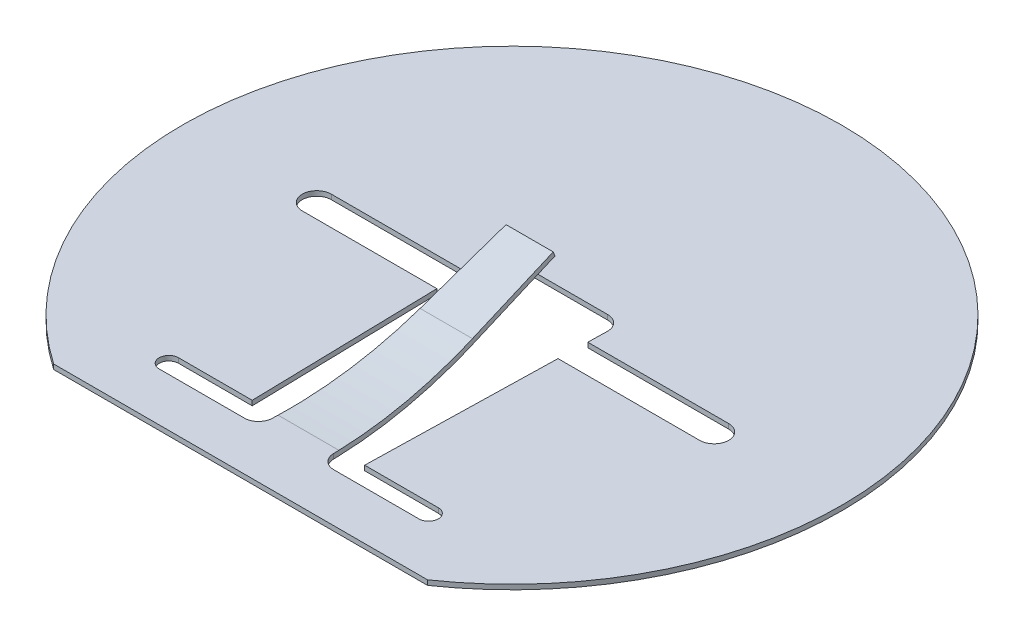
ISO-10303-21;
HEADER;
FILE_DESCRIPTION(('STEP AP214'),'2;1');
FILE_NAME('part.step','',(''),(''),'','','');
FILE_SCHEMA(('AUTOMOTIVE_DESIGN { 1 0 10303 214 1 1 1 1 }'));
ENDSEC;
DATA;
#1=APPLICATION_CONTEXT('core data for automotive mechanical design processes');
#2=APPLICATION_PROTOCOL_DEFINITION('international standard','automotive_design',2000,#1);
#3=PRODUCT_CONTEXT('',#1,'mechanical');
#4=PRODUCT('Part','Part','',(#3));
#5=PRODUCT_RELATED_PRODUCT_CATEGORY('part','',(#4));
#6=PRODUCT_DEFINITION_FORMATION('','',#4);
#7=PRODUCT_DEFINITION_CONTEXT('part definition',#1,'design');
#8=PRODUCT_DEFINITION('design','',#6,#7);
#9=PRODUCT_DEFINITION_SHAPE('','',#8);
#10=(LENGTH_UNIT() NAMED_UNIT(*) SI_UNIT(.MILLI.,.METRE.));
#11=(NAMED_UNIT(*) PLANE_ANGLE_UNIT() SI_UNIT($,.RADIAN.));
#12=(NAMED_UNIT(*) SI_UNIT($,.STERADIAN.) SOLID_ANGLE_UNIT());
#13=UNCERTAINTY_MEASURE_WITH_UNIT(LENGTH_MEASURE(1.E-05),#10,'distance_accuracy_value','');
#14=(GEOMETRIC_REPRESENTATION_CONTEXT(3) GLOBAL_UNCERTAINTY_ASSIGNED_CONTEXT((#13)) GLOBAL_UNIT_ASSIGNED_CONTEXT((#10,
#11,#12)) REPRESENTATION_CONTEXT('',''));
#15=CARTESIAN_POINT('',(0.,0.,0.));
#16=DIRECTION('',(0.,0.,1.));
#17=DIRECTION('',(1.,0.,0.));
#18=AXIS2_PLACEMENT_3D('',#15,#16,#17);
#19=CARTESIAN_POINT('',(0.,0.125,0.));
#20=DIRECTION('',(0.,1.,0.));
#21=DIRECTION('',(0.,0.,1.));
#22=AXIS2_PLACEMENT_3D('',#19,#20,#21);
#23=PLANE('',#22);
#24=CARTESIAN_POINT('',(0.,0.125,0.));
#25=DIRECTION('',(0.,1.,0.));
#26=DIRECTION('',(0.,0.,1.));
#27=AXIS2_PLACEMENT_3D('',#24,#25,#26);
#28=CIRCLE('',#27,8.5);
#29=CARTESIAN_POINT('',(4.82182538049648,0.125,7.));
#30=VERTEX_POINT('',#29);
#31=CARTESIAN_POINT('',(-4.82182538049648,0.125,7.));
#32=VERTEX_POINT('',#31);
#33=EDGE_CURVE('E396',#30,#32,#28,.T.);
#34=ORIENTED_EDGE('',*,*,#33,.T.);
#35=DIRECTION('',(1.,0.,0.));
#36=VECTOR('',#35,1.);
#37=CARTESIAN_POINT('',(4.82182538049648,0.125,7.));
#38=LINE('',#37,#36);
#39=EDGE_CURVE('E399',#32,#30,#38,.T.);
#40=ORIENTED_EDGE('',*,*,#39,.T.);
#41=EDGE_LOOP('',(#34,#40));
#42=FACE_BOUND('',#41,.T.);
#43=DIRECTION('',(1.,0.,0.));
#44=VECTOR('',#43,1.);
#45=CARTESIAN_POINT('',(-3.35,0.125,5.75));
#46=LINE('',#45,#44);
#47=CARTESIAN_POINT('',(1.15394197095874,0.125,5.75));
#48=VERTEX_POINT('',#47);
#49=CARTESIAN_POINT('',(3.35,0.125,5.75));
#50=VERTEX_POINT('',#49);
#51=EDGE_CURVE('E276',#48,#50,#46,.T.);
#52=ORIENTED_EDGE('',*,*,#51,.F.);
#53=CARTESIAN_POINT('',(1.15394197095874,0.125,5.385));
#54=DIRECTION('',(0.,1.,0.));
#55=DIRECTION('',(0.,0.,1.));
#56=AXIS2_PLACEMENT_3D('',#53,#54,#55);
#57=CIRCLE('',#56,0.365);
#58=CARTESIAN_POINT('',(0.789114629435761,0.125,5.39622545666225));
#59=VERTEX_POINT('',#58);
#60=EDGE_CURVE('E422',#48,#59,#57,.F.);
#61=ORIENTED_EDGE('',*,*,#60,.T.);
#62=DIRECTION('',(-0.030754675786974,0.,-0.999526963076654));
#63=VECTOR('',#62,1.);
#64=CARTESIAN_POINT('',(0.622487585717664,0.125,-0.0191534641759281));
#65=LINE('',#64,#63);
#66=CARTESIAN_POINT('',(0.784615384615385,0.125,5.25));
#67=VERTEX_POINT('',#66);
#68=EDGE_CURVE('E426',#59,#67,#65,.T.);
#69=ORIENTED_EDGE('',*,*,#68,.T.);
#70=DIRECTION('',(1.,0.,0.));
#71=VECTOR('',#70,1.);
#72=CARTESIAN_POINT('',(0.8,0.125,5.25));
#73=LINE('',#72,#71);
#74=CARTESIAN_POINT('',(-0.784615384615385,0.125,5.25));
#75=VERTEX_POINT('',#74);
#76=EDGE_CURVE('E537',#75,#67,#73,.T.);
#77=ORIENTED_EDGE('',*,*,#76,.F.);
#78=DIRECTION('',(-0.030754675786974,0.,0.999526963076654));
#79=VECTOR('',#78,1.);
#80=CARTESIAN_POINT('',(-0.622487585717664,0.125,-0.0191534641759281));
#81=LINE('',#80,#79);
#82=CARTESIAN_POINT('',(-0.789114629435762,0.125,5.39622545666225));
#83=VERTEX_POINT('',#82);
#84=EDGE_CURVE('E252',#75,#83,#81,.T.);
#85=ORIENTED_EDGE('',*,*,#84,.T.);
#86=CARTESIAN_POINT('',(-1.15394197095874,0.125,5.385));
#87=DIRECTION('',(0.,1.,0.));
#88=DIRECTION('',(0.,0.,1.));
#89=AXIS2_PLACEMENT_3D('',#86,#87,#88);
#90=CIRCLE('',#89,0.365);
#91=CARTESIAN_POINT('',(-1.15394197095874,0.125,5.75));
#92=VERTEX_POINT('',#91);
#93=EDGE_CURVE('E40',#83,#92,#90,.F.);
#94=ORIENTED_EDGE('',*,*,#93,.T.);
#95=CARTESIAN_POINT('',(-3.35,0.125,5.75));
#96=VERTEX_POINT('',#95);
#97=EDGE_CURVE('E277',#96,#92,#46,.T.);
#98=ORIENTED_EDGE('',*,*,#97,.F.);
#99=CARTESIAN_POINT('',(-3.35,0.125,5.5));
#100=DIRECTION('',(0.,1.,0.));
#101=DIRECTION('',(0.,0.,1.));
#102=AXIS2_PLACEMENT_3D('',#99,#100,#101);
#103=CIRCLE('',#102,0.249999999999998);
#104=CARTESIAN_POINT('',(-3.35,0.125,5.25));
#105=VERTEX_POINT('',#104);
#106=EDGE_CURVE('E274',#105,#96,#103,.T.);
#107=ORIENTED_EDGE('',*,*,#106,.F.);
#108=DIRECTION('',(-1.,0.,0.));
#109=VECTOR('',#108,1.);
#110=CARTESIAN_POINT('',(-1.45,0.125,5.25000000000001));
#111=LINE('',#110,#109);
#112=CARTESIAN_POINT('',(-1.45,0.125,5.25000000000001));
#113=VERTEX_POINT('',#112);
#114=EDGE_CURVE('E272',#113,#105,#111,.T.);
#115=ORIENTED_EDGE('',*,*,#114,.F.);
#116=DIRECTION('',(0.0230707807872646,0.,0.999733834114794));
#117=VECTOR('',#116,1.);
#118=CARTESIAN_POINT('',(-1.5625,0.125,0.375));
#119=LINE('',#118,#117);
#120=CARTESIAN_POINT('',(-1.5625,0.125,0.375));
#121=VERTEX_POINT('',#120);
#122=EDGE_CURVE('E270',#121,#113,#119,.T.);
#123=ORIENTED_EDGE('',*,*,#122,.F.);
#124=DIRECTION('',(1.,0.,0.));
#125=VECTOR('',#124,1.);
#126=CARTESIAN_POINT('',(-5.035,0.125,0.375));
#127=LINE('',#126,#125);
#128=CARTESIAN_POINT('',(-5.035,0.125,0.375));
#129=VERTEX_POINT('',#128);
#130=EDGE_CURVE('E267',#129,#121,#127,.T.);
#131=ORIENTED_EDGE('',*,*,#130,.F.);
#132=CARTESIAN_POINT('',(-5.035,0.125,0.));
#133=DIRECTION('',(0.,1.,0.));
#134=DIRECTION('',(0.,0.,1.));
#135=AXIS2_PLACEMENT_3D('',#132,#133,#134);
#136=CIRCLE('',#135,0.375);
#137=CARTESIAN_POINT('',(-5.035,0.125,-0.375));
#138=VERTEX_POINT('',#137);
#139=EDGE_CURVE('E265',#138,#129,#136,.T.);
#140=ORIENTED_EDGE('',*,*,#139,.F.);
#141=DIRECTION('',(-1.,0.,0.));
#142=VECTOR('',#141,1.);
#143=CARTESIAN_POINT('',(-5.035,0.125,-0.375));
#144=LINE('',#143,#142);
#145=CARTESIAN_POINT('',(-1.5798076923077,0.125,-0.375));
#146=VERTEX_POINT('',#145);
#147=EDGE_CURVE('E302',#146,#138,#144,.T.);
#148=ORIENTED_EDGE('',*,*,#147,.F.);
#149=DIRECTION('',(0.0230707807872637,0.,0.999733834114794));
#150=VECTOR('',#149,1.);
#151=CARTESIAN_POINT('',(-1.59114650285857,0.125,-0.866348457204776));
#152=LINE('',#151,#150);
#153=CARTESIAN_POINT('',(-1.59114650285857,0.125,-0.866348457204776));
#154=VERTEX_POINT('',#153);
#155=EDGE_CURVE('E299',#154,#146,#152,.T.);
#156=ORIENTED_EDGE('',*,*,#155,.F.);
#157=CARTESIAN_POINT('',(-1.21624631506553,0.125,-0.875));
#158=DIRECTION('',(0.,1.,0.));
#159=DIRECTION('',(0.,0.,-1.));
#160=AXIS2_PLACEMENT_3D('',#157,#158,#159);
#161=CIRCLE('',#160,0.375);
#162=CARTESIAN_POINT('',(-1.21624631506553,0.125,-1.25));
#163=VERTEX_POINT('',#162);
#164=EDGE_CURVE('E297',#163,#154,#161,.T.);
#165=ORIENTED_EDGE('',*,*,#164,.F.);
#166=DIRECTION('',(-1.,0.,0.));
#167=VECTOR('',#166,1.);
#168=CARTESIAN_POINT('',(-1.21624631506553,0.125,-1.25));
#169=LINE('',#168,#167);
#170=CARTESIAN_POINT('',(1.21624631506553,0.125,-1.25));
#171=VERTEX_POINT('',#170);
#172=EDGE_CURVE('E295',#171,#163,#169,.T.);
#173=ORIENTED_EDGE('',*,*,#172,.F.);
#174=CARTESIAN_POINT('',(1.21624631506553,0.125,-0.875));
#175=DIRECTION('',(0.,1.,0.));
#176=DIRECTION('',(0.,0.,-1.));
#177=AXIS2_PLACEMENT_3D('',#174,#175,#176);
#178=CIRCLE('',#177,0.375);
#179=CARTESIAN_POINT('',(1.59114650285858,0.125,-0.866348457204776));
#180=VERTEX_POINT('',#179);
#181=EDGE_CURVE('E293',#180,#171,#178,.T.);
#182=ORIENTED_EDGE('',*,*,#181,.F.);
#183=DIRECTION('',(0.0230707807872642,0.,-0.999733834114794));
#184=VECTOR('',#183,1.);
#185=CARTESIAN_POINT('',(1.59114650285858,0.125,-0.866348457204776));
#186=LINE('',#185,#184);
#187=CARTESIAN_POINT('',(1.5798076923077,0.125,-0.375));
#188=VERTEX_POINT('',#187);
#189=EDGE_CURVE('E291',#188,#180,#186,.T.);
#190=ORIENTED_EDGE('',*,*,#189,.F.);
#191=DIRECTION('',(-1.,0.,0.));
#192=VECTOR('',#191,1.);
#193=CARTESIAN_POINT('',(1.5798076923077,0.125,-0.375));
#194=LINE('',#193,#192);
#195=CARTESIAN_POINT('',(5.215,0.125,-0.375));
#196=VERTEX_POINT('',#195);
#197=EDGE_CURVE('E289',#196,#188,#194,.T.);
#198=ORIENTED_EDGE('',*,*,#197,.F.);
#199=CARTESIAN_POINT('',(5.215,0.125,0.));
#200=DIRECTION('',(0.,1.,0.));
#201=DIRECTION('',(0.,0.,1.));
#202=AXIS2_PLACEMENT_3D('',#199,#200,#201);
#203=CIRCLE('',#202,0.375);
#204=CARTESIAN_POINT('',(5.215,0.125,0.375));
#205=VERTEX_POINT('',#204);
#206=EDGE_CURVE('E287',#205,#196,#203,.T.);
#207=ORIENTED_EDGE('',*,*,#206,.F.);
#208=DIRECTION('',(1.,0.,0.));
#209=VECTOR('',#208,1.);
#210=CARTESIAN_POINT('',(1.5625,0.125,0.375));
#211=LINE('',#210,#209);
#212=CARTESIAN_POINT('',(1.5625,0.125,0.375));
#213=VERTEX_POINT('',#212);
#214=EDGE_CURVE('E285',#213,#205,#211,.T.);
#215=ORIENTED_EDGE('',*,*,#214,.F.);
#216=DIRECTION('',(0.0230707807872644,0.,-0.999733834114794));
#217=VECTOR('',#216,1.);
#218=CARTESIAN_POINT('',(1.5625,0.125,0.375));
#219=LINE('',#218,#217);
#220=CARTESIAN_POINT('',(1.45,0.125,5.25));
#221=VERTEX_POINT('',#220);
#222=EDGE_CURVE('E283',#221,#213,#219,.T.);
#223=ORIENTED_EDGE('',*,*,#222,.F.);
#224=DIRECTION('',(-1.,0.,0.));
#225=VECTOR('',#224,1.);
#226=CARTESIAN_POINT('',(1.45,0.125,5.25));
#227=LINE('',#226,#225);
#228=CARTESIAN_POINT('',(3.35,0.125,5.25));
#229=VERTEX_POINT('',#228);
#230=EDGE_CURVE('E281',#229,#221,#227,.T.);
#231=ORIENTED_EDGE('',*,*,#230,.F.);
#232=CARTESIAN_POINT('',(3.35,0.125,5.5));
#233=DIRECTION('',(0.,1.,0.));
#234=DIRECTION('',(0.,0.,-1.));
#235=AXIS2_PLACEMENT_3D('',#232,#233,#234);
#236=CIRCLE('',#235,0.25);
#237=EDGE_CURVE('E279',#50,#229,#236,.T.);
#238=ORIENTED_EDGE('',*,*,#237,.F.);
#239=EDGE_LOOP('',(#52,#61,#69,#77,#85,#94,#98,#107,#115,#123,#131,#140,#148,#156,#165,#173,
#182,#190,#198,#207,#215,#223,#231,#238));
#240=FACE_BOUND('',#239,.T.);
#241=ADVANCED_FACE('F32',(#42,#240),#23,.T.);
#242=CARTESIAN_POINT('',(0.,0.,0.));
#243=DIRECTION('',(0.,1.,0.));
#244=DIRECTION('',(0.,0.,1.));
#245=AXIS2_PLACEMENT_3D('',#242,#243,#244);
#246=PLANE('',#245);
#247=CARTESIAN_POINT('',(0.,0.,0.));
#248=DIRECTION('',(0.,1.,0.));
#249=DIRECTION('',(0.,0.,1.));
#250=AXIS2_PLACEMENT_3D('',#247,#248,#249);
#251=CIRCLE('',#250,8.5);
#252=CARTESIAN_POINT('',(4.82182538049648,0.,7.));
#253=VERTEX_POINT('',#252);
#254=CARTESIAN_POINT('',(-4.82182538049648,0.,7.));
#255=VERTEX_POINT('',#254);
#256=EDGE_CURVE('E395',#253,#255,#251,.T.);
#257=ORIENTED_EDGE('',*,*,#256,.F.);
#258=DIRECTION('',(1.,0.,0.));
#259=VECTOR('',#258,1.);
#260=CARTESIAN_POINT('',(4.82182538049648,0.,7.));
#261=LINE('',#260,#259);
#262=EDGE_CURVE('E400',#255,#253,#261,.T.);
#263=ORIENTED_EDGE('',*,*,#262,.F.);
#264=EDGE_LOOP('',(#257,#263));
#265=FACE_BOUND('',#264,.T.);
#266=DIRECTION('',(0.030754675786974,0.,0.999526963076654));
#267=VECTOR('',#266,1.);
#268=CARTESIAN_POINT('',(0.8,0.,5.75));
#269=LINE('',#268,#267);
#270=CARTESIAN_POINT('',(0.784615384615385,0.,5.25));
#271=VERTEX_POINT('',#270);
#272=CARTESIAN_POINT('',(0.789114629435761,0.,5.39622545666225));
#273=VERTEX_POINT('',#272);
#274=EDGE_CURVE('E442',#271,#273,#269,.T.);
#275=ORIENTED_EDGE('',*,*,#274,.T.);
#276=CARTESIAN_POINT('',(1.15394197095874,0.,5.385));
#277=DIRECTION('',(0.,1.,0.));
#278=DIRECTION('',(0.,0.,1.));
#279=AXIS2_PLACEMENT_3D('',#276,#277,#278);
#280=CIRCLE('',#279,0.365);
#281=CARTESIAN_POINT('',(1.15394197095874,0.,5.75));
#282=VERTEX_POINT('',#281);
#283=EDGE_CURVE('E420',#273,#282,#280,.T.);
#284=ORIENTED_EDGE('',*,*,#283,.T.);
#285=DIRECTION('',(1.,0.,0.));
#286=VECTOR('',#285,1.);
#287=CARTESIAN_POINT('',(-3.35,0.,5.75));
#288=LINE('',#287,#286);
#289=CARTESIAN_POINT('',(3.35,0.,5.75));
#290=VERTEX_POINT('',#289);
#291=EDGE_CURVE('E319',#282,#290,#288,.T.);
#292=ORIENTED_EDGE('',*,*,#291,.T.);
#293=CARTESIAN_POINT('',(3.35,0.,5.5));
#294=DIRECTION('',(0.,1.,0.));
#295=DIRECTION('',(0.,0.,-1.));
#296=AXIS2_PLACEMENT_3D('',#293,#294,#295);
#297=CIRCLE('',#296,0.25);
#298=CARTESIAN_POINT('',(3.35,0.,5.25));
#299=VERTEX_POINT('',#298);
#300=EDGE_CURVE('E322',#290,#299,#297,.T.);
#301=ORIENTED_EDGE('',*,*,#300,.T.);
#302=DIRECTION('',(-1.,0.,0.));
#303=VECTOR('',#302,1.);
#304=CARTESIAN_POINT('',(1.45,0.,5.25));
#305=LINE('',#304,#303);
#306=CARTESIAN_POINT('',(1.45,0.,5.25));
#307=VERTEX_POINT('',#306);
#308=EDGE_CURVE('E325',#299,#307,#305,.T.);
#309=ORIENTED_EDGE('',*,*,#308,.T.);
#310=DIRECTION('',(0.0230707807872644,0.,-0.999733834114794));
#311=VECTOR('',#310,1.);
#312=CARTESIAN_POINT('',(1.5625,0.,0.375));
#313=LINE('',#312,#311);
#314=CARTESIAN_POINT('',(1.5625,0.,0.375));
#315=VERTEX_POINT('',#314);
#316=EDGE_CURVE('E328',#307,#315,#313,.T.);
#317=ORIENTED_EDGE('',*,*,#316,.T.);
#318=DIRECTION('',(1.,0.,0.));
#319=VECTOR('',#318,1.);
#320=CARTESIAN_POINT('',(1.5625,0.,0.375));
#321=LINE('',#320,#319);
#322=CARTESIAN_POINT('',(5.215,0.,0.375));
#323=VERTEX_POINT('',#322);
#324=EDGE_CURVE('E331',#315,#323,#321,.T.);
#325=ORIENTED_EDGE('',*,*,#324,.T.);
#326=CARTESIAN_POINT('',(5.215,0.,0.));
#327=DIRECTION('',(0.,1.,0.));
#328=DIRECTION('',(0.,0.,1.));
#329=AXIS2_PLACEMENT_3D('',#326,#327,#328);
#330=CIRCLE('',#329,0.375);
#331=CARTESIAN_POINT('',(5.215,0.,-0.375));
#332=VERTEX_POINT('',#331);
#333=EDGE_CURVE('E334',#323,#332,#330,.T.);
#334=ORIENTED_EDGE('',*,*,#333,.T.);
#335=DIRECTION('',(-1.,0.,0.));
#336=VECTOR('',#335,1.);
#337=CARTESIAN_POINT('',(1.5798076923077,0.,-0.375));
#338=LINE('',#337,#336);
#339=CARTESIAN_POINT('',(1.5798076923077,0.,-0.375));
#340=VERTEX_POINT('',#339);
#341=EDGE_CURVE('E337',#332,#340,#338,.T.);
#342=ORIENTED_EDGE('',*,*,#341,.T.);
#343=DIRECTION('',(0.0230707807872642,0.,-0.999733834114794));
#344=VECTOR('',#343,1.);
#345=CARTESIAN_POINT('',(1.59114650285858,0.,-0.866348457204776));
#346=LINE('',#345,#344);
#347=CARTESIAN_POINT('',(1.59114650285858,0.,-0.866348457204776));
#348=VERTEX_POINT('',#347);
#349=EDGE_CURVE('E340',#340,#348,#346,.T.);
#350=ORIENTED_EDGE('',*,*,#349,.T.);
#351=CARTESIAN_POINT('',(1.21624631506553,0.,-0.875));
#352=DIRECTION('',(0.,1.,0.));
#353=DIRECTION('',(0.,0.,-1.));
#354=AXIS2_PLACEMENT_3D('',#351,#352,#353);
#355=CIRCLE('',#354,0.375);
#356=CARTESIAN_POINT('',(1.21624631506553,0.,-1.25));
#357=VERTEX_POINT('',#356);
#358=EDGE_CURVE('E343',#348,#357,#355,.T.);
#359=ORIENTED_EDGE('',*,*,#358,.T.);
#360=DIRECTION('',(-1.,0.,0.));
#361=VECTOR('',#360,1.);
#362=CARTESIAN_POINT('',(-1.21624631506553,0.,-1.25));
#363=LINE('',#362,#361);
#364=CARTESIAN_POINT('',(-1.21624631506553,0.,-1.25));
#365=VERTEX_POINT('',#364);
#366=EDGE_CURVE('E346',#357,#365,#363,.T.);
#367=ORIENTED_EDGE('',*,*,#366,.T.);
#368=CARTESIAN_POINT('',(-1.21624631506553,0.,-0.875));
#369=DIRECTION('',(0.,1.,0.));
#370=DIRECTION('',(0.,0.,-1.));
#371=AXIS2_PLACEMENT_3D('',#368,#369,#370);
#372=CIRCLE('',#371,0.375);
#373=CARTESIAN_POINT('',(-1.59114650285857,0.,-0.866348457204776));
#374=VERTEX_POINT('',#373);
#375=EDGE_CURVE('E349',#365,#374,#372,.T.);
#376=ORIENTED_EDGE('',*,*,#375,.T.);
#377=DIRECTION('',(0.0230707807872637,0.,0.999733834114794));
#378=VECTOR('',#377,1.);
#379=CARTESIAN_POINT('',(-1.59114650285857,0.,-0.866348457204776));
#380=LINE('',#379,#378);
#381=CARTESIAN_POINT('',(-1.5798076923077,0.,-0.375));
#382=VERTEX_POINT('',#381);
#383=EDGE_CURVE('E352',#374,#382,#380,.T.);
#384=ORIENTED_EDGE('',*,*,#383,.T.);
#385=DIRECTION('',(-1.,0.,0.));
#386=VECTOR('',#385,1.);
#387=CARTESIAN_POINT('',(-5.035,0.,-0.375));
#388=LINE('',#387,#386);
#389=CARTESIAN_POINT('',(-5.035,0.,-0.375));
#390=VERTEX_POINT('',#389);
#391=EDGE_CURVE('E268',#382,#390,#388,.T.);
#392=ORIENTED_EDGE('',*,*,#391,.T.);
#393=CARTESIAN_POINT('',(-5.035,0.,0.));
#394=DIRECTION('',(0.,1.,0.));
#395=DIRECTION('',(0.,0.,1.));
#396=AXIS2_PLACEMENT_3D('',#393,#394,#395);
#397=CIRCLE('',#396,0.375);
#398=CARTESIAN_POINT('',(-5.035,0.,0.375));
#399=VERTEX_POINT('',#398);
#400=EDGE_CURVE('E259',#390,#399,#397,.T.);
#401=ORIENTED_EDGE('',*,*,#400,.T.);
#402=DIRECTION('',(1.,0.,0.));
#403=VECTOR('',#402,1.);
#404=CARTESIAN_POINT('',(-5.035,0.,0.375));
#405=LINE('',#404,#403);
#406=CARTESIAN_POINT('',(-1.5625,0.,0.375));
#407=VERTEX_POINT('',#406);
#408=EDGE_CURVE('E307',#399,#407,#405,.T.);
#409=ORIENTED_EDGE('',*,*,#408,.T.);
#410=DIRECTION('',(0.0230707807872646,0.,0.999733834114794));
#411=VECTOR('',#410,1.);
#412=CARTESIAN_POINT('',(-1.5625,0.,0.375));
#413=LINE('',#412,#411);
#414=CARTESIAN_POINT('',(-1.45,0.,5.25000000000001));
#415=VERTEX_POINT('',#414);
#416=EDGE_CURVE('E310',#407,#415,#413,.T.);
#417=ORIENTED_EDGE('',*,*,#416,.T.);
#418=DIRECTION('',(-1.,0.,0.));
#419=VECTOR('',#418,1.);
#420=CARTESIAN_POINT('',(-1.45,0.,5.25000000000001));
#421=LINE('',#420,#419);
#422=CARTESIAN_POINT('',(-3.35,0.,5.25));
#423=VERTEX_POINT('',#422);
#424=EDGE_CURVE('E313',#415,#423,#421,.T.);
#425=ORIENTED_EDGE('',*,*,#424,.T.);
#426=CARTESIAN_POINT('',(-3.35,0.,5.5));
#427=DIRECTION('',(0.,1.,0.));
#428=DIRECTION('',(0.,0.,1.));
#429=AXIS2_PLACEMENT_3D('',#426,#427,#428);
#430=CIRCLE('',#429,0.249999999999998);
#431=CARTESIAN_POINT('',(-3.35,0.,5.75));
#432=VERTEX_POINT('',#431);
#433=EDGE_CURVE('E316',#423,#432,#430,.T.);
#434=ORIENTED_EDGE('',*,*,#433,.T.);
#435=CARTESIAN_POINT('',(-1.15394197095874,0.,5.75));
#436=VERTEX_POINT('',#435);
#437=EDGE_CURVE('E320',#432,#436,#288,.T.);
#438=ORIENTED_EDGE('',*,*,#437,.T.);
#439=CARTESIAN_POINT('',(-1.15394197095874,0.,5.385));
#440=DIRECTION('',(0.,1.,0.));
#441=DIRECTION('',(0.,0.,1.));
#442=AXIS2_PLACEMENT_3D('',#439,#440,#441);
#443=CIRCLE('',#442,0.365);
#444=CARTESIAN_POINT('',(-0.789114629435761,0.,5.39622545666224));
#445=VERTEX_POINT('',#444);
#446=EDGE_CURVE('E11',#436,#445,#443,.T.);
#447=ORIENTED_EDGE('',*,*,#446,.T.);
#448=DIRECTION('',(0.030754675786974,0.,-0.999526963076654));
#449=VECTOR('',#448,1.);
#450=CARTESIAN_POINT('',(-0.6,0.,-0.75));
#451=LINE('',#450,#449);
#452=CARTESIAN_POINT('',(-0.784615384615385,0.,5.25));
#453=VERTEX_POINT('',#452);
#454=EDGE_CURVE('E536',#445,#453,#451,.T.);
#455=ORIENTED_EDGE('',*,*,#454,.T.);
#456=DIRECTION('',(-1.,0.,0.));
#457=VECTOR('',#456,1.);
#458=CARTESIAN_POINT('',(0.8,0.,5.25));
#459=LINE('',#458,#457);
#460=EDGE_CURVE('E434',#271,#453,#459,.T.);
#461=ORIENTED_EDGE('',*,*,#460,.F.);
#462=EDGE_LOOP('',(#275,#284,#292,#301,#309,#317,#325,#334,#342,#350,#359,#367,#376,#384,#392,
#401,#409,#417,#425,#434,#438,#447,#455,#461));
#463=FACE_BOUND('',#462,.T.);
#464=ADVANCED_FACE('F440',(#265,#463),#246,.F.);
#465=CARTESIAN_POINT('',(0.8,0.670329243218185,1.65038285785138));
#466=DIRECTION('',(0.,-0.932967075678182,-0.359961714214862));
#467=DIRECTION('',(0.,0.359961714214862,-0.932967075678182));
#468=AXIS2_PLACEMENT_3D('',#465,#466,#467);
#469=PLANE('',#468);
#470=DIRECTION('',(-1.,0.,0.));
#471=VECTOR('',#470,1.);
#472=CARTESIAN_POINT('',(0.8,1.5,-0.5));
#473=LINE('',#472,#471);
#474=CARTESIAN_POINT('',(0.607692307692308,1.5,-0.5));
#475=VERTEX_POINT('',#474);
#476=CARTESIAN_POINT('',(-0.607692307692308,1.5,-0.5));
#477=VERTEX_POINT('',#476);
#478=EDGE_CURVE('E256',#475,#477,#473,.T.);
#479=ORIENTED_EDGE('',*,*,#478,.F.);
#480=DIRECTION('',(0.0286948583512325,-0.359813488377395,0.932582896415055));
#481=VECTOR('',#480,1.);
#482=CARTESIAN_POINT('',(0.673961798820952,0.669026851984155,1.65375846168094));
#483=LINE('',#482,#481);
#484=CARTESIAN_POINT('',(0.673857934087735,0.670329243218185,1.65038285785138));
#485=VERTEX_POINT('',#484);
#486=EDGE_CURVE('E236',#475,#485,#483,.T.);
#487=ORIENTED_EDGE('',*,*,#486,.T.);
#488=DIRECTION('',(-1.,0.,0.));
#489=VECTOR('',#488,1.);
#490=CARTESIAN_POINT('',(0.8,0.670329243218185,1.65038285785138));
#491=LINE('',#490,#489);
#492=CARTESIAN_POINT('',(-0.673857934087735,0.670329243218185,1.65038285785138));
#493=VERTEX_POINT('',#492);
#494=EDGE_CURVE('E257',#485,#493,#491,.T.);
#495=ORIENTED_EDGE('',*,*,#494,.T.);
#496=DIRECTION('',(0.0286948583512325,0.359813488377395,-0.932582896415055));
#497=VECTOR('',#496,1.);
#498=CARTESIAN_POINT('',(-0.672644366987676,0.685546527315119,1.61094192709948));
#499=LINE('',#498,#497);
#500=EDGE_CURVE('E553',#493,#477,#499,.T.);
#501=ORIENTED_EDGE('',*,*,#500,.T.);
#502=EDGE_LOOP('',(#479,#487,#495,#501));
#503=FACE_BOUND('',#502,.T.);
#504=ADVANCED_FACE('F564',(#503),#469,.T.);
#505=CARTESIAN_POINT('',(0.8,0.786950127677958,1.69537807212823));
#506=DIRECTION('',(0.,0.932967075678182,0.359961714214862));
#507=DIRECTION('',(0.,-0.359961714214862,0.932967075678182));
#508=AXIS2_PLACEMENT_3D('',#505,#506,#507);
#509=PLANE('',#508);
#510=DIRECTION('',(1.,0.,0.));
#511=VECTOR('',#510,1.);
#512=CARTESIAN_POINT('',(0.8,0.786950127677958,1.69537807212823));
#513=LINE('',#512,#511);
#514=CARTESIAN_POINT('',(-0.67524240221933,0.786950127677958,1.69537807212823));
#515=VERTEX_POINT('',#514);
#516=CARTESIAN_POINT('',(0.67524240221933,0.786950127677958,1.69537807212823));
#517=VERTEX_POINT('',#516);
#518=EDGE_CURVE('E251',#515,#517,#513,.T.);
#519=ORIENTED_EDGE('',*,*,#518,.T.);
#520=DIRECTION('',(-0.0286948583512325,0.359813488377395,-0.932582896415055));
#521=VECTOR('',#520,1.);
#522=CARTESIAN_POINT('',(0.675345126988555,0.785662030796453,1.69871662712803));
#523=LINE('',#522,#521);
#524=CARTESIAN_POINT('',(0.609076775823903,1.61662088445977,-0.455004785723142));
#525=VERTEX_POINT('',#524);
#526=EDGE_CURVE('E233',#517,#525,#523,.T.);
#527=ORIENTED_EDGE('',*,*,#526,.T.);
#528=DIRECTION('',(1.,0.,0.));
#529=VECTOR('',#528,1.);
#530=CARTESIAN_POINT('',(0.8,1.61662088445977,-0.455004785723143));
#531=LINE('',#530,#529);
#532=CARTESIAN_POINT('',(-0.609076775823903,1.61662088445977,-0.455004785723143));
#533=VERTEX_POINT('',#532);
#534=EDGE_CURVE('E249',#533,#525,#531,.T.);
#535=ORIENTED_EDGE('',*,*,#534,.F.);
#536=DIRECTION('',(-0.0286948583512325,-0.359813488377395,0.932582896415055));
#537=VECTOR('',#536,1.);
#538=CARTESIAN_POINT('',(-0.674027695155279,0.802181706127417,1.65590009254657));
#539=LINE('',#538,#537);
#540=EDGE_CURVE('E555',#533,#515,#539,.T.);
#541=ORIENTED_EDGE('',*,*,#540,.T.);
#542=EDGE_LOOP('',(#519,#527,#535,#541));
#543=FACE_BOUND('',#542,.T.);
#544=ADVANCED_FACE('F247',(#543),#509,.T.);
#545=CARTESIAN_POINT('',(0.,10.,5.25));
#546=DIRECTION('',(1.,0.,0.));
#547=DIRECTION('',(0.,0.,-1.));
#548=AXIS2_PLACEMENT_3D('',#545,#546,#547);
#549=CYLINDRICAL_SURFACE('',#548,10.);
#550=ORIENTED_EDGE('',*,*,#494,.F.);
#551=CARTESIAN_POINT('',(0.784615384615385,10.,5.25));
#552=DIRECTION('',(0.999526963076654,0.,-0.030754675786974));
#553=DIRECTION('',(0.030754675786974,0.,0.999526963076654));
#554=AXIS2_PLACEMENT_3D('',#551,#552,#553);
#555=ELLIPSE('',#554,10.0047326079318,10.);
#556=EDGE_CURVE('E435',#485,#271,#555,.F.);
#557=ORIENTED_EDGE('',*,*,#556,.T.);
#558=ORIENTED_EDGE('',*,*,#460,.T.);
#559=CARTESIAN_POINT('',(-0.784615384615385,10.,5.25));
#560=DIRECTION('',(-0.999526963076654,0.,-0.030754675786974));
#561=DIRECTION('',(0.030754675786974,0.,-0.999526963076654));
#562=AXIS2_PLACEMENT_3D('',#559,#560,#561);
#563=ELLIPSE('',#562,10.0047326079318,10.);
#564=EDGE_CURVE('E538',#453,#493,#563,.F.);
#565=ORIENTED_EDGE('',*,*,#564,.T.);
#566=EDGE_LOOP('',(#550,#557,#558,#565));
#567=FACE_BOUND('',#566,.T.);
#568=ADVANCED_FACE('F562',(#567),#549,.T.);
#569=CARTESIAN_POINT('',(0.,10.,5.25));
#570=DIRECTION('',(1.,0.,0.));
#571=DIRECTION('',(0.,0.,-1.));
#572=AXIS2_PLACEMENT_3D('',#569,#570,#571);
#573=CYLINDRICAL_SURFACE('',#572,9.875);
#574=ORIENTED_EDGE('',*,*,#76,.T.);
#575=CARTESIAN_POINT('',(0.784615384615385,10.,5.25));
#576=DIRECTION('',(0.999526963076654,0.,-0.030754675786974));
#577=DIRECTION('',(0.030754675786974,0.,0.999526963076654));
#578=AXIS2_PLACEMENT_3D('',#575,#576,#577);
#579=ELLIPSE('',#578,9.87967345033261,9.875);
#580=EDGE_CURVE('E432',#67,#517,#579,.T.);
#581=ORIENTED_EDGE('',*,*,#580,.T.);
#582=ORIENTED_EDGE('',*,*,#518,.F.);
#583=CARTESIAN_POINT('',(-0.784615384615385,10.,5.25));
#584=DIRECTION('',(-0.999526963076654,0.,-0.030754675786974));
#585=DIRECTION('',(0.030754675786974,0.,-0.999526963076654));
#586=AXIS2_PLACEMENT_3D('',#583,#584,#585);
#587=ELLIPSE('',#586,9.87967345033261,9.875);
#588=EDGE_CURVE('E541',#515,#75,#587,.T.);
#589=ORIENTED_EDGE('',*,*,#588,.T.);
#590=EDGE_LOOP('',(#574,#581,#582,#589));
#591=FACE_BOUND('',#590,.T.);
#592=ADVANCED_FACE('F552',(#591),#573,.F.);
#593=CARTESIAN_POINT('',(0.8,1.5,-0.5));
#594=DIRECTION('',(0.,0.359961714214862,-0.932967075678181));
#595=DIRECTION('',(-1.,0.,0.));
#596=AXIS2_PLACEMENT_3D('',#593,#594,#595);
#597=PLANE('',#596);
#598=ORIENTED_EDGE('',*,*,#534,.T.);
#599=DIRECTION('',(-0.0110750657726509,-0.93290985641405,-0.359939637611154));
#600=VECTOR('',#599,1.);
#601=CARTESIAN_POINT('',(0.607715895592667,1.50198693038841,-0.499233393238322));
#602=LINE('',#601,#600);
#603=EDGE_CURVE('E228',#525,#475,#602,.T.);
#604=ORIENTED_EDGE('',*,*,#603,.T.);
#605=ORIENTED_EDGE('',*,*,#478,.T.);
#606=DIRECTION('',(-0.0110750657726509,0.93290985641405,0.359939637611154));
#607=VECTOR('',#606,1.);
#608=CARTESIAN_POINT('',(-0.607519644261677,1.48545566955683,-0.505611561495486));
#609=LINE('',#608,#607);
#610=EDGE_CURVE('E242',#477,#533,#609,.T.);
#611=ORIENTED_EDGE('',*,*,#610,.T.);
#612=EDGE_LOOP('',(#598,#604,#605,#611));
#613=FACE_BOUND('',#612,.T.);
#614=ADVANCED_FACE('F255',(#613),#597,.T.);
#615=CARTESIAN_POINT('',(-3.35,0.125,5.75));
#616=DIRECTION('',(0.,0.,-1.));
#617=DIRECTION('',(-1.,0.,0.));
#618=AXIS2_PLACEMENT_3D('',#615,#616,#617);
#619=PLANE('',#618);
#620=ORIENTED_EDGE('',*,*,#291,.F.);
#621=DIRECTION('',(0.,-1.,0.));
#622=VECTOR('',#621,1.);
#623=CARTESIAN_POINT('',(1.15394197095874,0.125,5.75));
#624=LINE('',#623,#622);
#625=EDGE_CURVE('E414',#282,#48,#624,.F.);
#626=ORIENTED_EDGE('',*,*,#625,.T.);
#627=ORIENTED_EDGE('',*,*,#51,.T.);
#628=DIRECTION('',(0.,-1.,0.));
#629=VECTOR('',#628,1.);
#630=CARTESIAN_POINT('',(3.35,0.125,5.75));
#631=LINE('',#630,#629);
#632=EDGE_CURVE('E381',#50,#290,#631,.T.);
#633=ORIENTED_EDGE('',*,*,#632,.T.);
#634=EDGE_LOOP('',(#620,#626,#627,#633));
#635=FACE_BOUND('',#634,.T.);
#636=ADVANCED_FACE('F444',(#635),#619,.T.);
#637=ORIENTED_EDGE('',*,*,#97,.T.);
#638=DIRECTION('',(0.,1.,0.));
#639=VECTOR('',#638,1.);
#640=CARTESIAN_POINT('',(-1.15394197095874,0.,5.75));
#641=LINE('',#640,#639);
#642=EDGE_CURVE('E53',#92,#436,#641,.F.);
#643=ORIENTED_EDGE('',*,*,#642,.T.);
#644=ORIENTED_EDGE('',*,*,#437,.F.);
#645=DIRECTION('',(0.,-1.,0.));
#646=VECTOR('',#645,1.);
#647=CARTESIAN_POINT('',(-3.35,0.125,5.75));
#648=LINE('',#647,#646);
#649=EDGE_CURVE('E384',#96,#432,#648,.T.);
#650=ORIENTED_EDGE('',*,*,#649,.F.);
#651=EDGE_LOOP('',(#637,#643,#644,#650));
#652=FACE_BOUND('',#651,.T.);
#653=ADVANCED_FACE('F527',(#652),#619,.T.);
#654=CARTESIAN_POINT('',(0.,0.125,0.));
#655=DIRECTION('',(0.,-1.,0.));
#656=DIRECTION('',(0.,0.,-1.));
#657=AXIS2_PLACEMENT_3D('',#654,#655,#656);
#658=CYLINDRICAL_SURFACE('',#657,8.5);
#659=ORIENTED_EDGE('',*,*,#256,.T.);
#660=DIRECTION('',(0.,-1.,0.));
#661=VECTOR('',#660,1.);
#662=CARTESIAN_POINT('',(-4.82182538049648,0.125,7.));
#663=LINE('',#662,#661);
#664=EDGE_CURVE('E408',#32,#255,#663,.T.);
#665=ORIENTED_EDGE('',*,*,#664,.F.);
#666=ORIENTED_EDGE('',*,*,#33,.F.);
#667=DIRECTION('',(0.,-1.,0.));
#668=VECTOR('',#667,1.);
#669=CARTESIAN_POINT('',(4.82182538049648,0.125,7.));
#670=LINE('',#669,#668);
#671=EDGE_CURVE('E402',#30,#253,#670,.T.);
#672=ORIENTED_EDGE('',*,*,#671,.T.);
#673=EDGE_LOOP('',(#659,#665,#666,#672));
#674=FACE_BOUND('',#673,.T.);
#675=ADVANCED_FACE('F586',(#674),#658,.T.);
#676=CARTESIAN_POINT('',(4.82182538049648,0.125,7.));
#677=DIRECTION('',(0.,0.,-1.));
#678=DIRECTION('',(-1.,0.,0.));
#679=AXIS2_PLACEMENT_3D('',#676,#677,#678);
#680=PLANE('',#679);
#681=ORIENTED_EDGE('',*,*,#262,.T.);
#682=ORIENTED_EDGE('',*,*,#671,.F.);
#683=ORIENTED_EDGE('',*,*,#39,.F.);
#684=ORIENTED_EDGE('',*,*,#664,.T.);
#685=EDGE_LOOP('',(#681,#682,#683,#684));
#686=FACE_BOUND('',#685,.T.);
#687=ADVANCED_FACE('F583',(#686),#680,.F.);
#688=CARTESIAN_POINT('',(-5.035,0.125,0.));
#689=DIRECTION('',(0.,-1.,0.));
#690=DIRECTION('',(0.,0.,-1.));
#691=AXIS2_PLACEMENT_3D('',#688,#689,#690);
#692=CYLINDRICAL_SURFACE('',#691,0.375);
#693=ORIENTED_EDGE('',*,*,#400,.F.);
#694=DIRECTION('',(0.,-1.,0.));
#695=VECTOR('',#694,1.);
#696=CARTESIAN_POINT('',(-5.035,0.125,-0.375));
#697=LINE('',#696,#695);
#698=EDGE_CURVE('E304',#138,#390,#697,.T.);
#699=ORIENTED_EDGE('',*,*,#698,.F.);
#700=ORIENTED_EDGE('',*,*,#139,.T.);
#701=DIRECTION('',(0.,-1.,0.));
#702=VECTOR('',#701,1.);
#703=CARTESIAN_POINT('',(-5.035,0.125,0.375));
#704=LINE('',#703,#702);
#705=EDGE_CURVE('E392',#129,#399,#704,.T.);
#706=ORIENTED_EDGE('',*,*,#705,.T.);
#707=EDGE_LOOP('',(#693,#699,#700,#706));
#708=FACE_BOUND('',#707,.T.);
#709=ADVANCED_FACE('F506',(#708),#692,.F.);
#710=CARTESIAN_POINT('',(-5.035,0.125,0.375));
#711=DIRECTION('',(0.,0.,-1.));
#712=DIRECTION('',(-1.,0.,0.));
#713=AXIS2_PLACEMENT_3D('',#710,#711,#712);
#714=PLANE('',#713);
#715=ORIENTED_EDGE('',*,*,#408,.F.);
#716=ORIENTED_EDGE('',*,*,#705,.F.);
#717=ORIENTED_EDGE('',*,*,#130,.T.);
#718=DIRECTION('',(0.,-1.,0.));
#719=VECTOR('',#718,1.);
#720=CARTESIAN_POINT('',(-1.5625,0.125,0.375));
#721=LINE('',#720,#719);
#722=EDGE_CURVE('E390',#121,#407,#721,.T.);
#723=ORIENTED_EDGE('',*,*,#722,.T.);
#724=EDGE_LOOP('',(#715,#716,#717,#723));
#725=FACE_BOUND('',#724,.T.);
#726=ADVANCED_FACE('F513',(#725),#714,.T.);
#727=CARTESIAN_POINT('',(-1.5625,0.125,0.375));
#728=DIRECTION('',(0.999733834114794,0.,-0.0230707807872646));
#729=DIRECTION('',(-0.0230707807872646,0.,-0.999733834114794));
#730=AXIS2_PLACEMENT_3D('',#727,#728,#729);
#731=PLANE('',#730);
#732=ORIENTED_EDGE('',*,*,#416,.F.);
#733=ORIENTED_EDGE('',*,*,#722,.F.);
#734=ORIENTED_EDGE('',*,*,#122,.T.);
#735=DIRECTION('',(0.,-1.,0.));
#736=VECTOR('',#735,1.);
#737=CARTESIAN_POINT('',(-1.45,0.125,5.25000000000001));
#738=LINE('',#737,#736);
#739=EDGE_CURVE('E388',#113,#415,#738,.T.);
#740=ORIENTED_EDGE('',*,*,#739,.T.);
#741=EDGE_LOOP('',(#732,#733,#734,#740));
#742=FACE_BOUND('',#741,.T.);
#743=ADVANCED_FACE('F516',(#742),#731,.T.);
#744=CARTESIAN_POINT('',(-1.45,0.125,5.25000000000001));
#745=DIRECTION('',(0.,0.,1.));
#746=DIRECTION('',(1.,0.,0.));
#747=AXIS2_PLACEMENT_3D('',#744,#745,#746);
#748=PLANE('',#747);
#749=ORIENTED_EDGE('',*,*,#424,.F.);
#750=ORIENTED_EDGE('',*,*,#739,.F.);
#751=ORIENTED_EDGE('',*,*,#114,.T.);
#752=DIRECTION('',(0.,-1.,0.));
#753=VECTOR('',#752,1.);
#754=CARTESIAN_POINT('',(-3.35,0.125,5.25));
#755=LINE('',#754,#753);
#756=EDGE_CURVE('E386',#105,#423,#755,.T.);
#757=ORIENTED_EDGE('',*,*,#756,.T.);
#758=EDGE_LOOP('',(#749,#750,#751,#757));
#759=FACE_BOUND('',#758,.T.);
#760=ADVANCED_FACE('F521',(#759),#748,.T.);
#761=CARTESIAN_POINT('',(-3.35,0.125,5.5));
#762=DIRECTION('',(0.,-1.,0.));
#763=DIRECTION('',(0.,0.,-1.));
#764=AXIS2_PLACEMENT_3D('',#761,#762,#763);
#765=CYLINDRICAL_SURFACE('',#764,0.249999999999998);
#766=ORIENTED_EDGE('',*,*,#433,.F.);
#767=ORIENTED_EDGE('',*,*,#756,.F.);
#768=ORIENTED_EDGE('',*,*,#106,.T.);
#769=ORIENTED_EDGE('',*,*,#649,.T.);
#770=EDGE_LOOP('',(#766,#767,#768,#769));
#771=FACE_BOUND('',#770,.T.);
#772=ADVANCED_FACE('F525',(#771),#765,.F.);
#773=CARTESIAN_POINT('',(3.35,0.125,5.5));
#774=DIRECTION('',(0.,-1.,0.));
#775=DIRECTION('',(0.,0.,-1.));
#776=AXIS2_PLACEMENT_3D('',#773,#774,#775);
#777=CYLINDRICAL_SURFACE('',#776,0.25);
#778=ORIENTED_EDGE('',*,*,#300,.F.);
#779=ORIENTED_EDGE('',*,*,#632,.F.);
#780=ORIENTED_EDGE('',*,*,#237,.T.);
#781=DIRECTION('',(0.,-1.,0.));
#782=VECTOR('',#781,1.);
#783=CARTESIAN_POINT('',(3.35,0.125,5.25));
#784=LINE('',#783,#782);
#785=EDGE_CURVE('E379',#229,#299,#784,.T.);
#786=ORIENTED_EDGE('',*,*,#785,.T.);
#787=EDGE_LOOP('',(#778,#779,#780,#786));
#788=FACE_BOUND('',#787,.T.);
#789=ADVANCED_FACE('F448',(#788),#777,.F.);
#790=CARTESIAN_POINT('',(1.45,0.125,5.25));
#791=DIRECTION('',(0.,0.,1.));
#792=DIRECTION('',(1.,0.,0.));
#793=AXIS2_PLACEMENT_3D('',#790,#791,#792);
#794=PLANE('',#793);
#795=ORIENTED_EDGE('',*,*,#308,.F.);
#796=ORIENTED_EDGE('',*,*,#785,.F.);
#797=ORIENTED_EDGE('',*,*,#230,.T.);
#798=DIRECTION('',(0.,-1.,0.));
#799=VECTOR('',#798,1.);
#800=CARTESIAN_POINT('',(1.45,0.125,5.25));
#801=LINE('',#800,#799);
#802=EDGE_CURVE('E377',#221,#307,#801,.T.);
#803=ORIENTED_EDGE('',*,*,#802,.T.);
#804=EDGE_LOOP('',(#795,#796,#797,#803));
#805=FACE_BOUND('',#804,.T.);
#806=ADVANCED_FACE('F453',(#805),#794,.T.);
#807=CARTESIAN_POINT('',(1.5625,0.125,0.375));
#808=DIRECTION('',(-0.999733834114794,0.,-0.0230707807872644));
#809=DIRECTION('',(-0.0230707807872644,0.,0.999733834114794));
#810=AXIS2_PLACEMENT_3D('',#807,#808,#809);
#811=PLANE('',#810);
#812=ORIENTED_EDGE('',*,*,#316,.F.);
#813=ORIENTED_EDGE('',*,*,#802,.F.);
#814=ORIENTED_EDGE('',*,*,#222,.T.);
#815=DIRECTION('',(0.,-1.,0.));
#816=VECTOR('',#815,1.);
#817=CARTESIAN_POINT('',(1.5625,0.125,0.375));
#818=LINE('',#817,#816);
#819=EDGE_CURVE('E375',#213,#315,#818,.T.);
#820=ORIENTED_EDGE('',*,*,#819,.T.);
#821=EDGE_LOOP('',(#812,#813,#814,#820));
#822=FACE_BOUND('',#821,.T.);
#823=ADVANCED_FACE('F458',(#822),#811,.T.);
#824=CARTESIAN_POINT('',(1.5625,0.125,0.375));
#825=DIRECTION('',(0.,0.,-1.));
#826=DIRECTION('',(-1.,0.,0.));
#827=AXIS2_PLACEMENT_3D('',#824,#825,#826);
#828=PLANE('',#827);
#829=ORIENTED_EDGE('',*,*,#324,.F.);
#830=ORIENTED_EDGE('',*,*,#819,.F.);
#831=ORIENTED_EDGE('',*,*,#214,.T.);
#832=DIRECTION('',(0.,-1.,0.));
#833=VECTOR('',#832,1.);
#834=CARTESIAN_POINT('',(5.215,0.125,0.375));
#835=LINE('',#834,#833);
#836=EDGE_CURVE('E373',#205,#323,#835,.T.);
#837=ORIENTED_EDGE('',*,*,#836,.T.);
#838=EDGE_LOOP('',(#829,#830,#831,#837));
#839=FACE_BOUND('',#838,.T.);
#840=ADVANCED_FACE('F463',(#839),#828,.T.);
#841=CARTESIAN_POINT('',(5.215,0.125,0.));
#842=DIRECTION('',(0.,-1.,0.));
#843=DIRECTION('',(0.,0.,-1.));
#844=AXIS2_PLACEMENT_3D('',#841,#842,#843);
#845=CYLINDRICAL_SURFACE('',#844,0.375);
#846=ORIENTED_EDGE('',*,*,#333,.F.);
#847=ORIENTED_EDGE('',*,*,#836,.F.);
#848=ORIENTED_EDGE('',*,*,#206,.T.);
#849=DIRECTION('',(0.,-1.,0.));
#850=VECTOR('',#849,1.);
#851=CARTESIAN_POINT('',(5.215,0.125,-0.375));
#852=LINE('',#851,#850);
#853=EDGE_CURVE('E371',#196,#332,#852,.T.);
#854=ORIENTED_EDGE('',*,*,#853,.T.);
#855=EDGE_LOOP('',(#846,#847,#848,#854));
#856=FACE_BOUND('',#855,.T.);
#857=ADVANCED_FACE('F468',(#856),#845,.F.);
#858=CARTESIAN_POINT('',(1.5798076923077,0.125,-0.375));
#859=DIRECTION('',(0.,0.,1.));
#860=DIRECTION('',(1.,0.,0.));
#861=AXIS2_PLACEMENT_3D('',#858,#859,#860);
#862=PLANE('',#861);
#863=ORIENTED_EDGE('',*,*,#341,.F.);
#864=ORIENTED_EDGE('',*,*,#853,.F.);
#865=ORIENTED_EDGE('',*,*,#197,.T.);
#866=DIRECTION('',(0.,-1.,0.));
#867=VECTOR('',#866,1.);
#868=CARTESIAN_POINT('',(1.5798076923077,0.125,-0.375));
#869=LINE('',#868,#867);
#870=EDGE_CURVE('E369',#188,#340,#869,.T.);
#871=ORIENTED_EDGE('',*,*,#870,.T.);
#872=EDGE_LOOP('',(#863,#864,#865,#871));
#873=FACE_BOUND('',#872,.T.);
#874=ADVANCED_FACE('F473',(#873),#862,.T.);
#875=CARTESIAN_POINT('',(1.59114650285858,0.125,-0.866348457204776));
#876=DIRECTION('',(-0.999733834114794,0.,-0.0230707807872642));
#877=DIRECTION('',(-0.0230707807872642,0.,0.999733834114794));
#878=AXIS2_PLACEMENT_3D('',#875,#876,#877);
#879=PLANE('',#878);
#880=ORIENTED_EDGE('',*,*,#349,.F.);
#881=ORIENTED_EDGE('',*,*,#870,.F.);
#882=ORIENTED_EDGE('',*,*,#189,.T.);
#883=DIRECTION('',(0.,-1.,0.));
#884=VECTOR('',#883,1.);
#885=CARTESIAN_POINT('',(1.59114650285858,0.125,-0.866348457204776));
#886=LINE('',#885,#884);
#887=EDGE_CURVE('E367',#180,#348,#886,.T.);
#888=ORIENTED_EDGE('',*,*,#887,.T.);
#889=EDGE_LOOP('',(#880,#881,#882,#888));
#890=FACE_BOUND('',#889,.T.);
#891=ADVANCED_FACE('F478',(#890),#879,.T.);
#892=CARTESIAN_POINT('',(1.21624631506553,0.125,-0.875));
#893=DIRECTION('',(0.,-1.,0.));
#894=DIRECTION('',(0.,0.,-1.));
#895=AXIS2_PLACEMENT_3D('',#892,#893,#894);
#896=CYLINDRICAL_SURFACE('',#895,0.375);
#897=ORIENTED_EDGE('',*,*,#358,.F.);
#898=ORIENTED_EDGE('',*,*,#887,.F.);
#899=ORIENTED_EDGE('',*,*,#181,.T.);
#900=DIRECTION('',(0.,-1.,0.));
#901=VECTOR('',#900,1.);
#902=CARTESIAN_POINT('',(1.21624631506553,0.125,-1.25));
#903=LINE('',#902,#901);
#904=EDGE_CURVE('E365',#171,#357,#903,.T.);
#905=ORIENTED_EDGE('',*,*,#904,.T.);
#906=EDGE_LOOP('',(#897,#898,#899,#905));
#907=FACE_BOUND('',#906,.T.);
#908=ADVANCED_FACE('F483',(#907),#896,.F.);
#909=CARTESIAN_POINT('',(-1.21624631506553,0.125,-1.25));
#910=DIRECTION('',(0.,0.,1.));
#911=DIRECTION('',(1.,0.,0.));
#912=AXIS2_PLACEMENT_3D('',#909,#910,#911);
#913=PLANE('',#912);
#914=ORIENTED_EDGE('',*,*,#366,.F.);
#915=ORIENTED_EDGE('',*,*,#904,.F.);
#916=ORIENTED_EDGE('',*,*,#172,.T.);
#917=DIRECTION('',(0.,-1.,0.));
#918=VECTOR('',#917,1.);
#919=CARTESIAN_POINT('',(-1.21624631506553,0.125,-1.25));
#920=LINE('',#919,#918);
#921=EDGE_CURVE('E363',#163,#365,#920,.T.);
#922=ORIENTED_EDGE('',*,*,#921,.T.);
#923=EDGE_LOOP('',(#914,#915,#916,#922));
#924=FACE_BOUND('',#923,.T.);
#925=ADVANCED_FACE('F488',(#924),#913,.T.);
#926=CARTESIAN_POINT('',(-1.21624631506553,0.125,-0.875));
#927=DIRECTION('',(0.,-1.,0.));
#928=DIRECTION('',(0.,0.,-1.));
#929=AXIS2_PLACEMENT_3D('',#926,#927,#928);
#930=CYLINDRICAL_SURFACE('',#929,0.375);
#931=ORIENTED_EDGE('',*,*,#375,.F.);
#932=ORIENTED_EDGE('',*,*,#921,.F.);
#933=ORIENTED_EDGE('',*,*,#164,.T.);
#934=DIRECTION('',(0.,-1.,0.));
#935=VECTOR('',#934,1.);
#936=CARTESIAN_POINT('',(-1.59114650285857,0.125,-0.866348457204776));
#937=LINE('',#936,#935);
#938=EDGE_CURVE('E361',#154,#374,#937,.T.);
#939=ORIENTED_EDGE('',*,*,#938,.T.);
#940=EDGE_LOOP('',(#931,#932,#933,#939));
#941=FACE_BOUND('',#940,.T.);
#942=ADVANCED_FACE('F493',(#941),#930,.F.);
#943=CARTESIAN_POINT('',(-1.59114650285857,0.125,-0.866348457204776));
#944=DIRECTION('',(0.999733834114794,0.,-0.0230707807872637));
#945=DIRECTION('',(-0.0230707807872637,0.,-0.999733834114794));
#946=AXIS2_PLACEMENT_3D('',#943,#944,#945);
#947=PLANE('',#946);
#948=ORIENTED_EDGE('',*,*,#383,.F.);
#949=ORIENTED_EDGE('',*,*,#938,.F.);
#950=ORIENTED_EDGE('',*,*,#155,.T.);
#951=DIRECTION('',(0.,-1.,0.));
#952=VECTOR('',#951,1.);
#953=CARTESIAN_POINT('',(-1.5798076923077,0.125,-0.375));
#954=LINE('',#953,#952);
#955=EDGE_CURVE('E359',#146,#382,#954,.T.);
#956=ORIENTED_EDGE('',*,*,#955,.T.);
#957=EDGE_LOOP('',(#948,#949,#950,#956));
#958=FACE_BOUND('',#957,.T.);
#959=ADVANCED_FACE('F498',(#958),#947,.T.);
#960=CARTESIAN_POINT('',(-5.035,0.125,-0.375));
#961=DIRECTION('',(0.,0.,1.));
#962=DIRECTION('',(1.,0.,0.));
#963=AXIS2_PLACEMENT_3D('',#960,#961,#962);
#964=PLANE('',#963);
#965=ORIENTED_EDGE('',*,*,#391,.F.);
#966=ORIENTED_EDGE('',*,*,#955,.F.);
#967=ORIENTED_EDGE('',*,*,#147,.T.);
#968=ORIENTED_EDGE('',*,*,#698,.T.);
#969=EDGE_LOOP('',(#965,#966,#967,#968));
#970=FACE_BOUND('',#969,.T.);
#971=ADVANCED_FACE('F502',(#970),#964,.T.);
#972=CARTESIAN_POINT('',(-0.6,1.61662088445977,-0.75));
#973=DIRECTION('',(-0.999526963076654,0.,-0.030754675786974));
#974=DIRECTION('',(-0.030754675786974,0.,0.999526963076654));
#975=AXIS2_PLACEMENT_3D('',#972,#973,#974);
#976=PLANE('',#975);
#977=ORIENTED_EDGE('',*,*,#454,.F.);
#978=DIRECTION('',(0.,1.,0.));
#979=VECTOR('',#978,1.);
#980=CARTESIAN_POINT('',(-0.789114629435761,0.125,5.39622545666225));
#981=LINE('',#980,#979);
#982=EDGE_CURVE('E416',#445,#83,#981,.T.);
#983=ORIENTED_EDGE('',*,*,#982,.T.);
#984=ORIENTED_EDGE('',*,*,#84,.F.);
#985=ORIENTED_EDGE('',*,*,#588,.F.);
#986=ORIENTED_EDGE('',*,*,#540,.F.);
#987=ORIENTED_EDGE('',*,*,#610,.F.);
#988=ORIENTED_EDGE('',*,*,#500,.F.);
#989=ORIENTED_EDGE('',*,*,#564,.F.);
#990=EDGE_LOOP('',(#977,#983,#984,#985,#986,#987,#988,#989));
#991=FACE_BOUND('',#990,.T.);
#992=ADVANCED_FACE('F533',(#991),#976,.T.);
#993=CARTESIAN_POINT('',(0.8,1.61662088445977,5.75));
#994=DIRECTION('',(0.999526963076654,0.,-0.030754675786974));
#995=DIRECTION('',(-0.030754675786974,0.,-0.999526963076654));
#996=AXIS2_PLACEMENT_3D('',#993,#994,#995);
#997=PLANE('',#996);
#998=ORIENTED_EDGE('',*,*,#68,.F.);
#999=DIRECTION('',(0.,-1.,0.));
#1000=VECTOR('',#999,1.);
#1001=CARTESIAN_POINT('',(0.789114629435761,0.,5.39622545666225));
#1002=LINE('',#1001,#1000);
#1003=EDGE_CURVE('E241',#59,#273,#1002,.T.);
#1004=ORIENTED_EDGE('',*,*,#1003,.T.);
#1005=ORIENTED_EDGE('',*,*,#274,.F.);
#1006=ORIENTED_EDGE('',*,*,#556,.F.);
#1007=ORIENTED_EDGE('',*,*,#486,.F.);
#1008=ORIENTED_EDGE('',*,*,#603,.F.);
#1009=ORIENTED_EDGE('',*,*,#526,.F.);
#1010=ORIENTED_EDGE('',*,*,#580,.F.);
#1011=EDGE_LOOP('',(#998,#1004,#1005,#1006,#1007,#1008,#1009,#1010));
#1012=FACE_BOUND('',#1011,.T.);
#1013=ADVANCED_FACE('F231',(#1012),#997,.T.);
#1014=CARTESIAN_POINT('',(1.15394197095874,1.61662088445977,5.385));
#1015=DIRECTION('',(0.,1.,0.));
#1016=DIRECTION('',(0.,0.,1.));
#1017=AXIS2_PLACEMENT_3D('',#1014,#1015,#1016);
#1018=CYLINDRICAL_SURFACE('',#1017,0.365);
#1019=ORIENTED_EDGE('',*,*,#60,.F.);
#1020=ORIENTED_EDGE('',*,*,#625,.F.);
#1021=ORIENTED_EDGE('',*,*,#283,.F.);
#1022=ORIENTED_EDGE('',*,*,#1003,.F.);
#1023=EDGE_LOOP('',(#1019,#1020,#1021,#1022));
#1024=FACE_BOUND('',#1023,.T.);
#1025=ADVANCED_FACE('F437',(#1024),#1018,.F.);
#1026=CARTESIAN_POINT('',(-1.15394197095874,1.61662088445977,5.385));
#1027=DIRECTION('',(0.,-1.,0.));
#1028=DIRECTION('',(0.,0.,-1.));
#1029=AXIS2_PLACEMENT_3D('',#1026,#1027,#1028);
#1030=CYLINDRICAL_SURFACE('',#1029,0.365);
#1031=ORIENTED_EDGE('',*,*,#446,.F.);
#1032=ORIENTED_EDGE('',*,*,#642,.F.);
#1033=ORIENTED_EDGE('',*,*,#93,.F.);
#1034=ORIENTED_EDGE('',*,*,#982,.F.);
#1035=EDGE_LOOP('',(#1031,#1032,#1033,#1034));
#1036=FACE_BOUND('',#1035,.T.);
#1037=ADVANCED_FACE('F34',(#1036),#1030,.F.);
#1038=CLOSED_SHELL('',(#241,#464,#504,#544,#568,#592,#614,#636,#653,#675,#687,#709,#726,#743,
#760,#772,#789,#806,#823,#840,#857,#874,#891,#908,#925,#942,#959,#971,#992,#1013,#1025,#1037));
#1039=MANIFOLD_SOLID_BREP('B2',#1038);
#1040=ADVANCED_BREP_SHAPE_REPRESENTATION('',(#18,#1039),#14);
#1041=SHAPE_DEFINITION_REPRESENTATION(#9,#1040);
ENDSEC;
END-ISO-10303-21;
